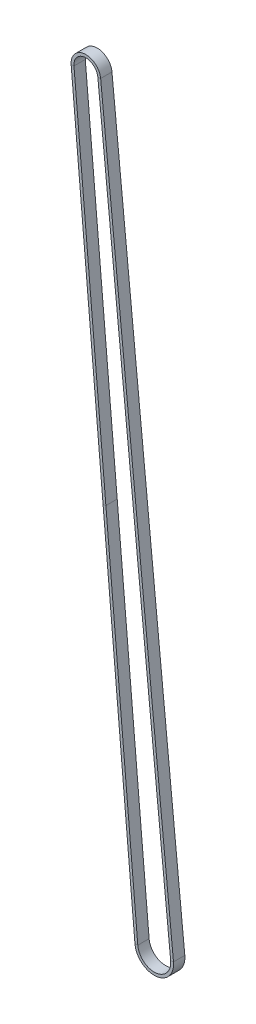
ISO-10303-21;
HEADER;
FILE_DESCRIPTION(('STEP AP214'),'2;1');
FILE_NAME('part.step','',(''),(''),'','','');
FILE_SCHEMA(('AUTOMOTIVE_DESIGN { 1 0 10303 214 1 1 1 1 }'));
ENDSEC;
DATA;
#1=APPLICATION_CONTEXT('core data for automotive mechanical design processes');
#2=APPLICATION_PROTOCOL_DEFINITION('international standard','automotive_design',2000,#1);
#3=PRODUCT_CONTEXT('',#1,'mechanical');
#4=PRODUCT('Part','Part','',(#3));
#5=PRODUCT_RELATED_PRODUCT_CATEGORY('part','',(#4));
#6=PRODUCT_DEFINITION_FORMATION('','',#4);
#7=PRODUCT_DEFINITION_CONTEXT('part definition',#1,'design');
#8=PRODUCT_DEFINITION('design','',#6,#7);
#9=PRODUCT_DEFINITION_SHAPE('','',#8);
#10=(LENGTH_UNIT() NAMED_UNIT(*) SI_UNIT(.MILLI.,.METRE.));
#11=(NAMED_UNIT(*) PLANE_ANGLE_UNIT() SI_UNIT($,.RADIAN.));
#12=(NAMED_UNIT(*) SI_UNIT($,.STERADIAN.) SOLID_ANGLE_UNIT());
#13=UNCERTAINTY_MEASURE_WITH_UNIT(LENGTH_MEASURE(1.E-05),#10,'distance_accuracy_value','');
#14=(GEOMETRIC_REPRESENTATION_CONTEXT(3) GLOBAL_UNCERTAINTY_ASSIGNED_CONTEXT((#13)) GLOBAL_UNIT_ASSIGNED_CONTEXT((#10,
#11,#12)) REPRESENTATION_CONTEXT('',''));
#15=CARTESIAN_POINT('',(0.,0.,0.));
#16=DIRECTION('',(0.,0.,1.));
#17=DIRECTION('',(1.,0.,0.));
#18=AXIS2_PLACEMENT_3D('',#15,#16,#17);
#19=CARTESIAN_POINT('',(-8.7167102082935,-0.762537307040539,-3.));
#20=DIRECTION('',(-0.996195452376422,-0.0871471208046218,0.));
#21=DIRECTION('',(0.0871471208046218,-0.996195452376422,0.));
#22=AXIS2_PLACEMENT_3D('',#19,#20,#21);
#23=PLANE('',#22);
#24=DIRECTION('',(0.,0.,1.));
#25=VECTOR('',#24,1.);
#26=CARTESIAN_POINT('',(-8.71671020829238,-0.76253730704029,-3.));
#27=LINE('',#26,#25);
#28=CARTESIAN_POINT('',(-8.71671020829352,-0.76253730704039,-3.));
#29=VERTEX_POINT('',#28);
#30=CARTESIAN_POINT('',(-8.71671020829352,-0.76253730704039,3.));
#31=VERTEX_POINT('',#30);
#32=EDGE_CURVE('E167',#29,#31,#27,.T.);
#33=ORIENTED_EDGE('',*,*,#32,.F.);
#34=DIRECTION('',(-0.0871471208046218,0.996195452376422,0.));
#35=VECTOR('',#34,1.);
#36=CARTESIAN_POINT('',(-8.7167102082935,-0.762537307040539,-3.));
#37=LINE('',#36,#35);
#38=CARTESIAN_POINT('',(-25.6232516388894,192.499380391105,-3.));
#39=VERTEX_POINT('',#38);
#40=EDGE_CURVE('E166',#29,#39,#37,.T.);
#41=ORIENTED_EDGE('',*,*,#40,.T.);
#42=DIRECTION('',(0.,0.,1.));
#43=VECTOR('',#42,1.);
#44=CARTESIAN_POINT('',(-25.6232516388894,192.499380391105,-3.));
#45=LINE('',#44,#43);
#46=CARTESIAN_POINT('',(-25.6232516388894,192.499380391105,3.));
#47=VERTEX_POINT('',#46);
#48=EDGE_CURVE('E141',#39,#47,#45,.T.);
#49=ORIENTED_EDGE('',*,*,#48,.T.);
#50=DIRECTION('',(-0.0871471208046218,0.996195452376422,0.));
#51=VECTOR('',#50,1.);
#52=CARTESIAN_POINT('',(-8.7167102082935,-0.762537307040539,3.));
#53=LINE('',#52,#51);
#54=EDGE_CURVE('E171',#31,#47,#53,.T.);
#55=ORIENTED_EDGE('',*,*,#54,.F.);
#56=EDGE_LOOP('',(#33,#41,#49,#55));
#57=FACE_BOUND('',#56,.T.);
#58=ADVANCED_FACE('F33',(#57),#23,.F.);
#59=CARTESIAN_POINT('',(-25.6232516388894,192.499380391105,-3.));
#60=DIRECTION('',(-0.996195452376422,-0.0871471208046218,0.));
#61=DIRECTION('',(0.0871471208046218,-0.996195452376422,0.));
#62=AXIS2_PLACEMENT_3D('',#59,#60,#61);
#63=PLANE('',#62);
#64=DIRECTION('',(-0.0871471208046218,0.996195452376422,0.));
#65=VECTOR('',#64,1.);
#66=CARTESIAN_POINT('',(-25.6232516388894,192.499380391105,3.));
#67=LINE('',#66,#65);
#68=CARTESIAN_POINT('',(-42.5297930694852,385.761298089251,3.));
#69=VERTEX_POINT('',#68);
#70=EDGE_CURVE('E147',#47,#69,#67,.T.);
#71=ORIENTED_EDGE('',*,*,#70,.F.);
#72=ORIENTED_EDGE('',*,*,#48,.F.);
#73=DIRECTION('',(-0.0871471208046218,0.996195452376422,0.));
#74=VECTOR('',#73,1.);
#75=CARTESIAN_POINT('',(-25.6232516388894,192.499380391105,-3.));
#76=LINE('',#75,#74);
#77=CARTESIAN_POINT('',(-42.5297930694852,385.761298089251,-3.));
#78=VERTEX_POINT('',#77);
#79=EDGE_CURVE('E145',#39,#78,#76,.T.);
#80=ORIENTED_EDGE('',*,*,#79,.T.);
#81=DIRECTION('',(0.,0.,1.));
#82=VECTOR('',#81,1.);
#83=CARTESIAN_POINT('',(-42.5297930694852,385.761298089251,-3.));
#84=LINE('',#83,#82);
#85=EDGE_CURVE('E163',#78,#69,#84,.T.);
#86=ORIENTED_EDGE('',*,*,#85,.T.);
#87=EDGE_LOOP('',(#71,#72,#80,#86));
#88=FACE_BOUND('',#87,.T.);
#89=ADVANCED_FACE('F143',(#88),#63,.F.);
#90=CARTESIAN_POINT('',(-27.117544817454,192.368659709898,3.));
#91=DIRECTION('',(0.,0.,-1.));
#92=DIRECTION('',(-1.,0.,0.));
#93=AXIS2_PLACEMENT_3D('',#90,#91,#92);
#94=PLANE('',#93);
#95=DIRECTION('',(-0.0871471208046218,0.996195452376422,0.));
#96=VECTOR('',#95,1.);
#97=CARTESIAN_POINT('',(-27.117544817454,192.368659709898,3.));
#98=LINE('',#97,#96);
#99=CARTESIAN_POINT('',(-27.117544817454,192.368659709898,3.));
#100=VERTEX_POINT('',#99);
#101=CARTESIAN_POINT('',(-44.0240862480499,385.630577408044,3.));
#102=VERTEX_POINT('',#101);
#103=EDGE_CURVE('E212',#100,#102,#98,.T.);
#104=ORIENTED_EDGE('',*,*,#103,.F.);
#105=DIRECTION('',(-0.996195452376423,-0.0871471208046168,0.));
#106=VECTOR('',#105,1.);
#107=CARTESIAN_POINT('',(-27.117544817454,192.368659709898,3.));
#108=LINE('',#107,#106);
#109=EDGE_CURVE('E152',#47,#100,#108,.T.);
#110=ORIENTED_EDGE('',*,*,#109,.F.);
#111=ORIENTED_EDGE('',*,*,#70,.T.);
#112=DIRECTION('',(-0.996195452376423,-0.0871471208046168,0.));
#113=VECTOR('',#112,1.);
#114=CARTESIAN_POINT('',(-44.0240862480499,385.630577408044,3.));
#115=LINE('',#114,#113);
#116=EDGE_CURVE('E237',#69,#102,#115,.T.);
#117=ORIENTED_EDGE('',*,*,#116,.T.);
#118=EDGE_LOOP('',(#104,#110,#111,#117));
#119=FACE_BOUND('',#118,.T.);
#120=ADVANCED_FACE('F257',(#119),#94,.F.);
#121=CARTESIAN_POINT('',(-27.117544817454,192.368659709898,-3.));
#122=DIRECTION('',(0.996195452376422,0.0871471208046218,0.));
#123=DIRECTION('',(-0.0871471208046218,0.996195452376422,0.));
#124=AXIS2_PLACEMENT_3D('',#121,#122,#123);
#125=PLANE('',#124);
#126=DIRECTION('',(-0.0871471208046218,0.996195452376422,0.));
#127=VECTOR('',#126,1.);
#128=CARTESIAN_POINT('',(-27.117544817454,192.368659709898,-3.));
#129=LINE('',#128,#127);
#130=CARTESIAN_POINT('',(-27.117544817454,192.368659709898,-3.));
#131=VERTEX_POINT('',#130);
#132=CARTESIAN_POINT('',(-44.0240862480499,385.630577408044,-3.));
#133=VERTEX_POINT('',#132);
#134=EDGE_CURVE('E182',#131,#133,#129,.T.);
#135=ORIENTED_EDGE('',*,*,#134,.F.);
#136=DIRECTION('',(0.,0.,-1.));
#137=VECTOR('',#136,1.);
#138=CARTESIAN_POINT('',(-27.117544817454,192.368659709898,-3.));
#139=LINE('',#138,#137);
#140=EDGE_CURVE('E174',#100,#131,#139,.T.);
#141=ORIENTED_EDGE('',*,*,#140,.F.);
#142=ORIENTED_EDGE('',*,*,#103,.T.);
#143=DIRECTION('',(0.,0.,-1.));
#144=VECTOR('',#143,1.);
#145=CARTESIAN_POINT('',(-44.0240862480499,385.630577408044,-3.));
#146=LINE('',#145,#144);
#147=EDGE_CURVE('E214',#102,#133,#146,.T.);
#148=ORIENTED_EDGE('',*,*,#147,.T.);
#149=EDGE_LOOP('',(#135,#141,#142,#148));
#150=FACE_BOUND('',#149,.T.);
#151=ADVANCED_FACE('F210',(#150),#125,.F.);
#152=CARTESIAN_POINT('',(-27.117544817454,192.368659709898,-3.));
#153=DIRECTION('',(0.,0.,1.));
#154=DIRECTION('',(1.,0.,0.));
#155=AXIS2_PLACEMENT_3D('',#152,#153,#154);
#156=PLANE('',#155);
#157=DIRECTION('',(0.996195452376423,0.0871471208046168,0.));
#158=VECTOR('',#157,1.);
#159=CARTESIAN_POINT('',(-44.0240862480499,385.630577408044,-3.));
#160=LINE('',#159,#158);
#161=EDGE_CURVE('E161',#133,#78,#160,.T.);
#162=ORIENTED_EDGE('',*,*,#161,.T.);
#163=ORIENTED_EDGE('',*,*,#79,.F.);
#164=DIRECTION('',(0.996195452376423,0.0871471208046168,0.));
#165=VECTOR('',#164,1.);
#166=CARTESIAN_POINT('',(-27.117544817454,192.368659709898,-3.));
#167=LINE('',#166,#165);
#168=EDGE_CURVE('E159',#131,#39,#167,.T.);
#169=ORIENTED_EDGE('',*,*,#168,.F.);
#170=ORIENTED_EDGE('',*,*,#134,.T.);
#171=EDGE_LOOP('',(#162,#163,#169,#170));
#172=FACE_BOUND('',#171,.T.);
#173=ADVANCED_FACE('F157',(#172),#156,.F.);
#174=CARTESIAN_POINT('',(-36.203951946895,386.31468230636,0.));
#175=DIRECTION('',(0.,0.,-1.));
#176=DIRECTION('',(-1.,0.,0.));
#177=AXIS2_PLACEMENT_3D('',#174,#175,#176);
#178=CYLINDRICAL_SURFACE('',#177,6.35000000000084);
#179=CARTESIAN_POINT('',(-36.203951946895,386.31468230636,3.));
#180=DIRECTION('',(0.,0.,-1.));
#181=DIRECTION('',(-0.996195452376423,-0.0871471208046146,0.));
#182=AXIS2_PLACEMENT_3D('',#179,#180,#181);
#183=CIRCLE('',#182,6.35000000000084);
#184=CARTESIAN_POINT('',(-29.8854406032159,386.946279012977,3.));
#185=VERTEX_POINT('',#184);
#186=EDGE_CURVE('E126',#69,#185,#183,.T.);
#187=ORIENTED_EDGE('',*,*,#186,.F.);
#188=ORIENTED_EDGE('',*,*,#85,.F.);
#189=CARTESIAN_POINT('',(-36.203951946895,386.31468230636,-3.));
#190=DIRECTION('',(0.,0.,-1.));
#191=DIRECTION('',(-0.996195452376423,-0.0871471208046146,0.));
#192=AXIS2_PLACEMENT_3D('',#189,#190,#191);
#193=CIRCLE('',#192,6.35000000000084);
#194=CARTESIAN_POINT('',(-29.8854406032159,386.946279012977,-3.));
#195=VERTEX_POINT('',#194);
#196=EDGE_CURVE('E181',#78,#195,#193,.T.);
#197=ORIENTED_EDGE('',*,*,#196,.T.);
#198=DIRECTION('',(0.,0.,1.));
#199=VECTOR('',#198,1.);
#200=CARTESIAN_POINT('',(-29.8854406032167,386.946279012977,-3.));
#201=LINE('',#200,#199);
#202=EDGE_CURVE('E242',#195,#185,#201,.T.);
#203=ORIENTED_EDGE('',*,*,#202,.T.);
#204=EDGE_LOOP('',(#187,#188,#197,#203));
#205=FACE_BOUND('',#204,.T.);
#206=ADVANCED_FACE('F282',(#205),#178,.F.);
#207=CARTESIAN_POINT('',(-44.0240862480507,385.630577408043,3.));
#208=DIRECTION('',(0.,0.,-1.));
#209=DIRECTION('',(-1.,0.,0.));
#210=AXIS2_PLACEMENT_3D('',#207,#208,#209);
#211=PLANE('',#210);
#212=CARTESIAN_POINT('',(-36.203951946895,386.31468230636,3.));
#213=DIRECTION('',(0.,0.,-1.));
#214=DIRECTION('',(-0.996195452376423,-0.0871471208046186,0.));
#215=AXIS2_PLACEMENT_3D('',#212,#213,#214);
#216=CIRCLE('',#215,7.85000000000084);
#217=CARTESIAN_POINT('',(-28.3928788684887,387.095475085406,3.));
#218=VERTEX_POINT('',#217);
#219=EDGE_CURVE('E120',#102,#218,#216,.T.);
#220=ORIENTED_EDGE('',*,*,#219,.F.);
#221=ORIENTED_EDGE('',*,*,#116,.F.);
#222=ORIENTED_EDGE('',*,*,#186,.T.);
#223=DIRECTION('',(0.995041156484764,0.0994640482861192,0.));
#224=VECTOR('',#223,1.);
#225=CARTESIAN_POINT('',(-28.3928788684896,387.095475085406,3.));
#226=LINE('',#225,#224);
#227=EDGE_CURVE('E219',#185,#218,#226,.T.);
#228=ORIENTED_EDGE('',*,*,#227,.T.);
#229=EDGE_LOOP('',(#220,#221,#222,#228));
#230=FACE_BOUND('',#229,.T.);
#231=ADVANCED_FACE('F284',(#230),#211,.F.);
#232=CARTESIAN_POINT('',(-36.203951946895,386.31468230636,0.));
#233=DIRECTION('',(0.,0.,-1.));
#234=DIRECTION('',(-1.,0.,0.));
#235=AXIS2_PLACEMENT_3D('',#232,#233,#234);
#236=CYLINDRICAL_SURFACE('',#235,7.85000000000084);
#237=CARTESIAN_POINT('',(-36.203951946895,386.31468230636,-3.));
#238=DIRECTION('',(0.,0.,-1.));
#239=DIRECTION('',(-0.996195452376423,-0.0871471208046186,0.));
#240=AXIS2_PLACEMENT_3D('',#237,#238,#239);
#241=CIRCLE('',#240,7.85000000000084);
#242=CARTESIAN_POINT('',(-28.3928788684887,387.095475085406,-3.));
#243=VERTEX_POINT('',#242);
#244=EDGE_CURVE('E186',#133,#243,#241,.T.);
#245=ORIENTED_EDGE('',*,*,#244,.F.);
#246=ORIENTED_EDGE('',*,*,#147,.F.);
#247=ORIENTED_EDGE('',*,*,#219,.T.);
#248=DIRECTION('',(0.,0.,-1.));
#249=VECTOR('',#248,1.);
#250=CARTESIAN_POINT('',(-28.3928788684896,387.095475085406,-3.));
#251=LINE('',#250,#249);
#252=EDGE_CURVE('E218',#218,#243,#251,.T.);
#253=ORIENTED_EDGE('',*,*,#252,.T.);
#254=EDGE_LOOP('',(#245,#246,#247,#253));
#255=FACE_BOUND('',#254,.T.);
#256=ADVANCED_FACE('F290',(#255),#236,.T.);
#257=CARTESIAN_POINT('',(-44.0240862480507,385.630577408043,-3.));
#258=DIRECTION('',(0.,0.,1.));
#259=DIRECTION('',(1.,0.,0.));
#260=AXIS2_PLACEMENT_3D('',#257,#258,#259);
#261=PLANE('',#260);
#262=DIRECTION('',(-0.995041156484764,-0.0994640482861192,0.));
#263=VECTOR('',#262,1.);
#264=CARTESIAN_POINT('',(-28.3928788684896,387.095475085406,-3.));
#265=LINE('',#264,#263);
#266=EDGE_CURVE('E183',#243,#195,#265,.T.);
#267=ORIENTED_EDGE('',*,*,#266,.T.);
#268=ORIENTED_EDGE('',*,*,#196,.F.);
#269=ORIENTED_EDGE('',*,*,#161,.F.);
#270=ORIENTED_EDGE('',*,*,#244,.T.);
#271=EDGE_LOOP('',(#267,#268,#269,#270));
#272=FACE_BOUND('',#271,.T.);
#273=ADVANCED_FACE('F280',(#272),#261,.F.);
#274=CARTESIAN_POINT('',(-29.8854406032167,386.946279012977,-3.));
#275=DIRECTION('',(0.995041156484764,0.0994640482861212,0.));
#276=DIRECTION('',(-0.0994640482861212,0.995041156484764,0.));
#277=AXIS2_PLACEMENT_3D('',#274,#275,#276);
#278=PLANE('',#277);
#279=DIRECTION('',(0.0994640482861212,-0.995041156484764,0.));
#280=VECTOR('',#279,1.);
#281=CARTESIAN_POINT('',(-29.8854406032167,386.946279012977,3.));
#282=LINE('',#281,#280);
#283=CARTESIAN_POINT('',(8.70661011924194,0.870310422502851,3.));
#284=VERTEX_POINT('',#283);
#285=EDGE_CURVE('E103',#185,#284,#282,.T.);
#286=ORIENTED_EDGE('',*,*,#285,.F.);
#287=ORIENTED_EDGE('',*,*,#202,.F.);
#288=DIRECTION('',(0.0994640482861212,-0.995041156484764,0.));
#289=VECTOR('',#288,1.);
#290=CARTESIAN_POINT('',(-29.8854406032167,386.946279012977,-3.));
#291=LINE('',#290,#289);
#292=CARTESIAN_POINT('',(8.70661011924194,0.870310422502851,-3.));
#293=VERTEX_POINT('',#292);
#294=EDGE_CURVE('E185',#195,#293,#291,.T.);
#295=ORIENTED_EDGE('',*,*,#294,.T.);
#296=DIRECTION('',(0.,0.,1.));
#297=VECTOR('',#296,1.);
#298=CARTESIAN_POINT('',(8.70661011924192,0.87031042250299,-3.));
#299=LINE('',#298,#297);
#300=EDGE_CURVE('E195',#293,#284,#299,.T.);
#301=ORIENTED_EDGE('',*,*,#300,.T.);
#302=EDGE_LOOP('',(#286,#287,#295,#301));
#303=FACE_BOUND('',#302,.T.);
#304=ADVANCED_FACE('F276',(#303),#278,.F.);
#305=CARTESIAN_POINT('',(-28.3928788684895,387.095475085406,3.));
#306=DIRECTION('',(0.,0.,-1.));
#307=DIRECTION('',(-1.,0.,0.));
#308=AXIS2_PLACEMENT_3D('',#305,#306,#307);
#309=PLANE('',#308);
#310=DIRECTION('',(0.0994640482861212,-0.995041156484764,0.));
#311=VECTOR('',#310,1.);
#312=CARTESIAN_POINT('',(-28.3928788684895,387.095475085406,3.));
#313=LINE('',#312,#311);
#314=CARTESIAN_POINT('',(10.1991718539691,1.01950649493199,3.));
#315=VERTEX_POINT('',#314);
#316=EDGE_CURVE('E96',#218,#315,#313,.T.);
#317=ORIENTED_EDGE('',*,*,#316,.F.);
#318=ORIENTED_EDGE('',*,*,#227,.F.);
#319=ORIENTED_EDGE('',*,*,#285,.T.);
#320=DIRECTION('',(0.995041156484764,0.0994640482861161,0.));
#321=VECTOR('',#320,1.);
#322=CARTESIAN_POINT('',(10.1991718539691,1.01950649493215,3.));
#323=LINE('',#322,#321);
#324=EDGE_CURVE('E193',#284,#315,#323,.T.);
#325=ORIENTED_EDGE('',*,*,#324,.T.);
#326=EDGE_LOOP('',(#317,#318,#319,#325));
#327=FACE_BOUND('',#326,.T.);
#328=ADVANCED_FACE('F279',(#327),#309,.F.);
#329=CARTESIAN_POINT('',(-28.3928788684895,387.095475085406,-3.));
#330=DIRECTION('',(-0.995041156484764,-0.0994640482861212,0.));
#331=DIRECTION('',(0.0994640482861212,-0.995041156484764,0.));
#332=AXIS2_PLACEMENT_3D('',#329,#330,#331);
#333=PLANE('',#332);
#334=DIRECTION('',(0.0994640482861212,-0.995041156484764,0.));
#335=VECTOR('',#334,1.);
#336=CARTESIAN_POINT('',(-28.3928788684895,387.095475085406,-3.));
#337=LINE('',#336,#335);
#338=CARTESIAN_POINT('',(10.1991718539691,1.01950649493199,-3.));
#339=VERTEX_POINT('',#338);
#340=EDGE_CURVE('E87',#243,#339,#337,.T.);
#341=ORIENTED_EDGE('',*,*,#340,.F.);
#342=ORIENTED_EDGE('',*,*,#252,.F.);
#343=ORIENTED_EDGE('',*,*,#316,.T.);
#344=DIRECTION('',(0.,0.,-1.));
#345=VECTOR('',#344,1.);
#346=CARTESIAN_POINT('',(10.1991718539691,1.01950649493215,-3.));
#347=LINE('',#346,#345);
#348=EDGE_CURVE('E189',#315,#339,#347,.T.);
#349=ORIENTED_EDGE('',*,*,#348,.T.);
#350=EDGE_LOOP('',(#341,#342,#343,#349));
#351=FACE_BOUND('',#350,.T.);
#352=ADVANCED_FACE('F294',(#351),#333,.F.);
#353=CARTESIAN_POINT('',(-28.3928788684895,387.095475085406,-3.));
#354=DIRECTION('',(0.,0.,1.));
#355=DIRECTION('',(1.,0.,0.));
#356=AXIS2_PLACEMENT_3D('',#353,#354,#355);
#357=PLANE('',#356);
#358=DIRECTION('',(-0.995041156484764,-0.0994640482861161,0.));
#359=VECTOR('',#358,1.);
#360=CARTESIAN_POINT('',(10.1991718539691,1.01950649493215,-3.));
#361=LINE('',#360,#359);
#362=EDGE_CURVE('E187',#339,#293,#361,.T.);
#363=ORIENTED_EDGE('',*,*,#362,.T.);
#364=ORIENTED_EDGE('',*,*,#294,.F.);
#365=ORIENTED_EDGE('',*,*,#266,.F.);
#366=ORIENTED_EDGE('',*,*,#340,.T.);
#367=EDGE_LOOP('',(#363,#364,#365,#366));
#368=FACE_BOUND('',#367,.T.);
#369=ADVANCED_FACE('F275',(#368),#357,.F.);
#370=CARTESIAN_POINT('',(1.83876605490038E-13,0.,0.));
#371=DIRECTION('',(0.,0.,-1.));
#372=DIRECTION('',(-1.,0.,0.));
#373=AXIS2_PLACEMENT_3D('',#370,#371,#372);
#374=CYLINDRICAL_SURFACE('',#373,8.75);
#375=CARTESIAN_POINT('',(1.83876605490038E-13,0.,3.));
#376=DIRECTION('',(0.,0.,-1.));
#377=DIRECTION('',(0.995041156484768,0.0994640482860835,0.));
#378=AXIS2_PLACEMENT_3D('',#375,#376,#377);
#379=CIRCLE('',#378,8.75);
#380=EDGE_CURVE('E227',#284,#31,#379,.T.);
#381=ORIENTED_EDGE('',*,*,#380,.F.);
#382=ORIENTED_EDGE('',*,*,#300,.F.);
#383=CARTESIAN_POINT('',(1.83876605490038E-13,0.,-3.));
#384=DIRECTION('',(0.,0.,-1.));
#385=DIRECTION('',(0.995041156484768,0.0994640482860835,0.));
#386=AXIS2_PLACEMENT_3D('',#383,#384,#385);
#387=CIRCLE('',#386,8.75);
#388=EDGE_CURVE('E188',#293,#29,#387,.T.);
#389=ORIENTED_EDGE('',*,*,#388,.T.);
#390=ORIENTED_EDGE('',*,*,#32,.T.);
#391=EDGE_LOOP('',(#381,#382,#389,#390));
#392=FACE_BOUND('',#391,.T.);
#393=ADVANCED_FACE('F272',(#392),#374,.F.);
#394=CARTESIAN_POINT('',(10.199171853969,1.01950649493232,3.));
#395=DIRECTION('',(0.,0.,-1.));
#396=DIRECTION('',(-1.,0.,0.));
#397=AXIS2_PLACEMENT_3D('',#394,#395,#396);
#398=PLANE('',#397);
#399=CARTESIAN_POINT('',(1.83876605490038E-13,0.,3.));
#400=DIRECTION('',(0.,0.,-1.));
#401=DIRECTION('',(0.995041156484768,0.0994640482860819,0.));
#402=AXIS2_PLACEMENT_3D('',#399,#400,#401);
#403=CIRCLE('',#402,10.25);
#404=CARTESIAN_POINT('',(-10.2110033868581,-0.893257988247317,3.));
#405=VERTEX_POINT('',#404);
#406=EDGE_CURVE('E58',#315,#405,#403,.T.);
#407=ORIENTED_EDGE('',*,*,#406,.F.);
#408=ORIENTED_EDGE('',*,*,#324,.F.);
#409=ORIENTED_EDGE('',*,*,#380,.T.);
#410=DIRECTION('',(-0.996195452376423,-0.0871471208046168,0.));
#411=VECTOR('',#410,1.);
#412=CARTESIAN_POINT('',(-10.211003386857,-0.893257988247215,3.));
#413=LINE('',#412,#411);
#414=EDGE_CURVE('E225',#31,#405,#413,.T.);
#415=ORIENTED_EDGE('',*,*,#414,.T.);
#416=EDGE_LOOP('',(#407,#408,#409,#415));
#417=FACE_BOUND('',#416,.T.);
#418=ADVANCED_FACE('F253',(#417),#398,.F.);
#419=CARTESIAN_POINT('',(1.83876605490038E-13,0.,0.));
#420=DIRECTION('',(0.,0.,-1.));
#421=DIRECTION('',(-1.,0.,0.));
#422=AXIS2_PLACEMENT_3D('',#419,#420,#421);
#423=CYLINDRICAL_SURFACE('',#422,10.25);
#424=CARTESIAN_POINT('',(1.83876605490038E-13,0.,-3.));
#425=DIRECTION('',(0.,0.,-1.));
#426=DIRECTION('',(0.995041156484768,0.0994640482860819,0.));
#427=AXIS2_PLACEMENT_3D('',#424,#425,#426);
#428=CIRCLE('',#427,10.25);
#429=CARTESIAN_POINT('',(-10.2110033868581,-0.893257988247317,-3.));
#430=VERTEX_POINT('',#429);
#431=EDGE_CURVE('E50',#339,#430,#428,.T.);
#432=ORIENTED_EDGE('',*,*,#431,.F.);
#433=ORIENTED_EDGE('',*,*,#348,.F.);
#434=ORIENTED_EDGE('',*,*,#406,.T.);
#435=DIRECTION('',(0.,0.,-1.));
#436=VECTOR('',#435,1.);
#437=CARTESIAN_POINT('',(-10.211003386857,-0.893257988247215,-3.));
#438=LINE('',#437,#436);
#439=EDGE_CURVE('E201',#405,#430,#438,.T.);
#440=ORIENTED_EDGE('',*,*,#439,.T.);
#441=EDGE_LOOP('',(#432,#433,#434,#440));
#442=FACE_BOUND('',#441,.T.);
#443=ADVANCED_FACE('F303',(#442),#423,.T.);
#444=CARTESIAN_POINT('',(10.199171853969,1.01950649493232,-3.));
#445=DIRECTION('',(0.,0.,1.));
#446=DIRECTION('',(1.,0.,0.));
#447=AXIS2_PLACEMENT_3D('',#444,#445,#446);
#448=PLANE('',#447);
#449=DIRECTION('',(0.996195452376423,0.0871471208046168,0.));
#450=VECTOR('',#449,1.);
#451=CARTESIAN_POINT('',(-10.211003386857,-0.893257988247215,-3.));
#452=LINE('',#451,#450);
#453=EDGE_CURVE('E37',#430,#29,#452,.T.);
#454=ORIENTED_EDGE('',*,*,#453,.T.);
#455=ORIENTED_EDGE('',*,*,#388,.F.);
#456=ORIENTED_EDGE('',*,*,#362,.F.);
#457=ORIENTED_EDGE('',*,*,#431,.T.);
#458=EDGE_LOOP('',(#454,#455,#456,#457));
#459=FACE_BOUND('',#458,.T.);
#460=ADVANCED_FACE('F202',(#459),#448,.F.);
#461=CARTESIAN_POINT('',(-10.2110033868581,-0.893257988247464,3.));
#462=DIRECTION('',(0.,0.,-1.));
#463=DIRECTION('',(-1.,0.,0.));
#464=AXIS2_PLACEMENT_3D('',#461,#462,#463);
#465=PLANE('',#464);
#466=ORIENTED_EDGE('',*,*,#54,.T.);
#467=ORIENTED_EDGE('',*,*,#109,.T.);
#468=DIRECTION('',(-0.0871471208046218,0.996195452376422,0.));
#469=VECTOR('',#468,1.);
#470=CARTESIAN_POINT('',(-10.2110033868581,-0.893257988247464,3.));
#471=LINE('',#470,#469);
#472=EDGE_CURVE('E42',#405,#100,#471,.T.);
#473=ORIENTED_EDGE('',*,*,#472,.F.);
#474=ORIENTED_EDGE('',*,*,#414,.F.);
#475=EDGE_LOOP('',(#466,#467,#473,#474));
#476=FACE_BOUND('',#475,.T.);
#477=ADVANCED_FACE('F256',(#476),#465,.F.);
#478=CARTESIAN_POINT('',(-10.2110033868581,-0.893257988247464,-3.));
#479=DIRECTION('',(0.996195452376422,0.0871471208046218,0.));
#480=DIRECTION('',(-0.0871471208046218,0.996195452376422,0.));
#481=AXIS2_PLACEMENT_3D('',#478,#479,#480);
#482=PLANE('',#481);
#483=ORIENTED_EDGE('',*,*,#472,.T.);
#484=ORIENTED_EDGE('',*,*,#140,.T.);
#485=DIRECTION('',(-0.0871471208046218,0.996195452376422,0.));
#486=VECTOR('',#485,1.);
#487=CARTESIAN_POINT('',(-10.2110033868581,-0.893257988247464,-3.));
#488=LINE('',#487,#486);
#489=EDGE_CURVE('E11',#430,#131,#488,.T.);
#490=ORIENTED_EDGE('',*,*,#489,.F.);
#491=ORIENTED_EDGE('',*,*,#439,.F.);
#492=EDGE_LOOP('',(#483,#484,#490,#491));
#493=FACE_BOUND('',#492,.T.);
#494=ADVANCED_FACE('F206',(#493),#482,.F.);
#495=CARTESIAN_POINT('',(-10.2110033868581,-0.893257988247464,-3.));
#496=DIRECTION('',(0.,0.,1.));
#497=DIRECTION('',(1.,0.,0.));
#498=AXIS2_PLACEMENT_3D('',#495,#496,#497);
#499=PLANE('',#498);
#500=ORIENTED_EDGE('',*,*,#489,.T.);
#501=ORIENTED_EDGE('',*,*,#168,.T.);
#502=ORIENTED_EDGE('',*,*,#40,.F.);
#503=ORIENTED_EDGE('',*,*,#453,.F.);
#504=EDGE_LOOP('',(#500,#501,#502,#503));
#505=FACE_BOUND('',#504,.T.);
#506=ADVANCED_FACE('F35',(#505),#499,.F.);
#507=CLOSED_SHELL('',(#58,#89,#120,#151,#173,#206,#231,#256,#273,#304,#328,#352,#369,#393,#418,
#443,#460,#477,#494,#506));
#508=MANIFOLD_SOLID_BREP('B2',#507);
#509=ADVANCED_BREP_SHAPE_REPRESENTATION('',(#18,#508),#14);
#510=SHAPE_DEFINITION_REPRESENTATION(#9,#509);
ENDSEC;
END-ISO-10303-21;
